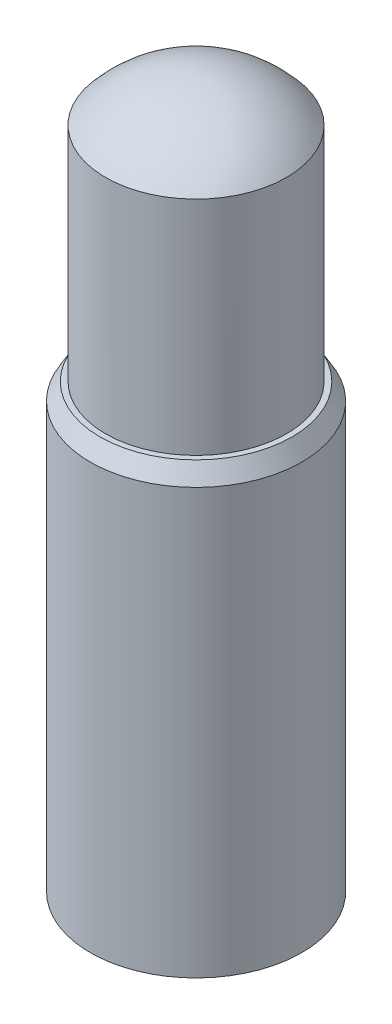
ISO-10303-21;
HEADER;
FILE_DESCRIPTION(('STEP AP214'),'2;1');
FILE_NAME('part.step','',(''),(''),'','','');
FILE_SCHEMA(('AUTOMOTIVE_DESIGN { 1 0 10303 214 1 1 1 1 }'));
ENDSEC;
DATA;
#1=APPLICATION_CONTEXT('core data for automotive mechanical design processes');
#2=APPLICATION_PROTOCOL_DEFINITION('international standard','automotive_design',2000,#1);
#3=PRODUCT_CONTEXT('',#1,'mechanical');
#4=PRODUCT('Part','Part','',(#3));
#5=PRODUCT_RELATED_PRODUCT_CATEGORY('part','',(#4));
#6=PRODUCT_DEFINITION_FORMATION('','',#4);
#7=PRODUCT_DEFINITION_CONTEXT('part definition',#1,'design');
#8=PRODUCT_DEFINITION('design','',#6,#7);
#9=PRODUCT_DEFINITION_SHAPE('','',#8);
#10=(LENGTH_UNIT() NAMED_UNIT(*) SI_UNIT(.MILLI.,.METRE.));
#11=(NAMED_UNIT(*) PLANE_ANGLE_UNIT() SI_UNIT($,.RADIAN.));
#12=(NAMED_UNIT(*) SI_UNIT($,.STERADIAN.) SOLID_ANGLE_UNIT());
#13=UNCERTAINTY_MEASURE_WITH_UNIT(LENGTH_MEASURE(1.E-05),#10,'distance_accuracy_value','');
#14=(GEOMETRIC_REPRESENTATION_CONTEXT(3) GLOBAL_UNCERTAINTY_ASSIGNED_CONTEXT((#13)) GLOBAL_UNIT_ASSIGNED_CONTEXT((#10,
#11,#12)) REPRESENTATION_CONTEXT('',''));
#15=CARTESIAN_POINT('',(0.,0.,0.));
#16=DIRECTION('',(0.,0.,1.));
#17=DIRECTION('',(1.,0.,0.));
#18=AXIS2_PLACEMENT_3D('',#15,#16,#17);
#19=CARTESIAN_POINT('',(-0.735,4.04,0.));
#20=DIRECTION('',(0.,-1.,0.));
#21=DIRECTION('',(0.,0.,-1.));
#22=AXIS2_PLACEMENT_3D('',#19,#20,#21);
#23=PLANE('',#22);
#24=CARTESIAN_POINT('',(-1.27,4.04,0.));
#25=DIRECTION('',(0.,-1.,0.));
#26=DIRECTION('',(0.,0.,-1.));
#27=AXIS2_PLACEMENT_3D('',#24,#25,#26);
#28=CIRCLE('',#27,0.567264973081037);
#29=CARTESIAN_POINT('',(-1.27,4.04,-0.567264973081037));
#30=VERTEX_POINT('',#29);
#31=EDGE_CURVE('E41',#30,#30,#28,.T.);
#32=ORIENTED_EDGE('',*,*,#31,.F.);
#33=EDGE_LOOP('',(#32));
#34=FACE_BOUND('',#33,.T.);
#35=CARTESIAN_POINT('',(-1.27,4.04,0.));
#36=DIRECTION('',(0.,-1.,0.));
#37=DIRECTION('',(0.,0.,-1.));
#38=AXIS2_PLACEMENT_3D('',#35,#36,#37);
#39=CIRCLE('',#38,0.535);
#40=CARTESIAN_POINT('',(-1.27,4.04,-0.535));
#41=VERTEX_POINT('',#40);
#42=EDGE_CURVE('E10',#41,#41,#39,.T.);
#43=ORIENTED_EDGE('',*,*,#42,.T.);
#44=EDGE_LOOP('',(#43));
#45=FACE_BOUND('',#44,.T.);
#46=ADVANCED_FACE('F14',(#34,#45),#23,.F.);
#47=CARTESIAN_POINT('',(-1.27,5.6,0.));
#48=DIRECTION('',(0.,-1.,0.));
#49=DIRECTION('',(0.,0.,-1.));
#50=AXIS2_PLACEMENT_3D('',#47,#48,#49);
#51=CYLINDRICAL_SURFACE('',#50,0.535);
#52=ORIENTED_EDGE('',*,*,#42,.F.);
#53=EDGE_LOOP('',(#52));
#54=FACE_BOUND('',#53,.T.);
#55=CARTESIAN_POINT('',(-1.27,5.35141444372107,0.));
#56=DIRECTION('',(0.,-1.,0.));
#57=DIRECTION('',(0.,0.,-1.));
#58=AXIS2_PLACEMENT_3D('',#55,#56,#57);
#59=CIRCLE('',#58,0.535);
#60=CARTESIAN_POINT('',(-1.27,5.35141444372107,-0.535));
#61=VERTEX_POINT('',#60);
#62=EDGE_CURVE('E21',#61,#61,#59,.T.);
#63=ORIENTED_EDGE('',*,*,#62,.T.);
#64=EDGE_LOOP('',(#63));
#65=FACE_BOUND('',#64,.T.);
#66=ADVANCED_FACE('F50',(#54,#65),#51,.T.);
#67=CARTESIAN_POINT('',(-1.27,4.9,0.));
#68=DIRECTION('',(0.,-1.,0.));
#69=DIRECTION('',(1.,0.,0.));
#70=AXIS2_PLACEMENT_3D('',#67,#68,#69);
#71=SPHERICAL_SURFACE('',#70,0.7);
#72=ORIENTED_EDGE('',*,*,#62,.F.);
#73=EDGE_LOOP('',(#72));
#74=FACE_BOUND('',#73,.T.);
#75=ADVANCED_FACE('F55',(#74),#71,.T.);
#76=CARTESIAN_POINT('',(-0.645,1.43,0.));
#77=DIRECTION('',(0.,1.,0.));
#78=DIRECTION('',(0.,0.,1.));
#79=AXIS2_PLACEMENT_3D('',#76,#77,#78);
#80=PLANE('',#79);
#81=CARTESIAN_POINT('',(-1.27,1.43,0.));
#82=DIRECTION('',(0.,-1.,0.));
#83=DIRECTION('',(0.,0.,-1.));
#84=AXIS2_PLACEMENT_3D('',#81,#82,#83);
#85=CIRCLE('',#84,0.625);
#86=CARTESIAN_POINT('',(-1.27,1.43,-0.625));
#87=VERTEX_POINT('',#86);
#88=EDGE_CURVE('E29',#87,#87,#85,.T.);
#89=ORIENTED_EDGE('',*,*,#88,.T.);
#90=EDGE_LOOP('',(#89));
#91=FACE_BOUND('',#90,.T.);
#92=ADVANCED_FACE('F60',(#91),#80,.F.);
#93=CARTESIAN_POINT('',(-1.27,5.6,0.));
#94=DIRECTION('',(0.,-1.,0.));
#95=DIRECTION('',(0.,0.,-1.));
#96=AXIS2_PLACEMENT_3D('',#93,#94,#95);
#97=CYLINDRICAL_SURFACE('',#96,0.625);
#98=ORIENTED_EDGE('',*,*,#88,.F.);
#99=EDGE_LOOP('',(#98));
#100=FACE_BOUND('',#99,.T.);
#101=CARTESIAN_POINT('',(-1.27,3.94,0.));
#102=DIRECTION('',(0.,-1.,0.));
#103=DIRECTION('',(0.,0.,-1.));
#104=AXIS2_PLACEMENT_3D('',#101,#102,#103);
#105=CIRCLE('',#104,0.625);
#106=CARTESIAN_POINT('',(-1.27,3.94,-0.625));
#107=VERTEX_POINT('',#106);
#108=EDGE_CURVE('E35',#107,#107,#105,.T.);
#109=ORIENTED_EDGE('',*,*,#108,.T.);
#110=EDGE_LOOP('',(#109));
#111=FACE_BOUND('',#110,.T.);
#112=ADVANCED_FACE('F66',(#100,#111),#97,.T.);
#113=CARTESIAN_POINT('',(-1.27,4.04,0.));
#114=DIRECTION('',(0.,-1.,0.));
#115=DIRECTION('',(0.,0.,-1.));
#116=AXIS2_PLACEMENT_3D('',#113,#114,#115);
#117=CONICAL_SURFACE('',#116,0.567264973081037,0.523598775598299);
#118=ORIENTED_EDGE('',*,*,#108,.F.);
#119=EDGE_LOOP('',(#118));
#120=FACE_BOUND('',#119,.T.);
#121=ORIENTED_EDGE('',*,*,#31,.T.);
#122=EDGE_LOOP('',(#121));
#123=FACE_BOUND('',#122,.T.);
#124=ADVANCED_FACE('F47',(#120,#123),#117,.T.);
#125=CLOSED_SHELL('',(#46,#66,#75,#92,#112,#124));
#126=MANIFOLD_SOLID_BREP('B1',#125);
#127=ADVANCED_BREP_SHAPE_REPRESENTATION('',(#18,#126),#14);
#128=SHAPE_DEFINITION_REPRESENTATION(#9,#127);
ENDSEC;
END-ISO-10303-21;
